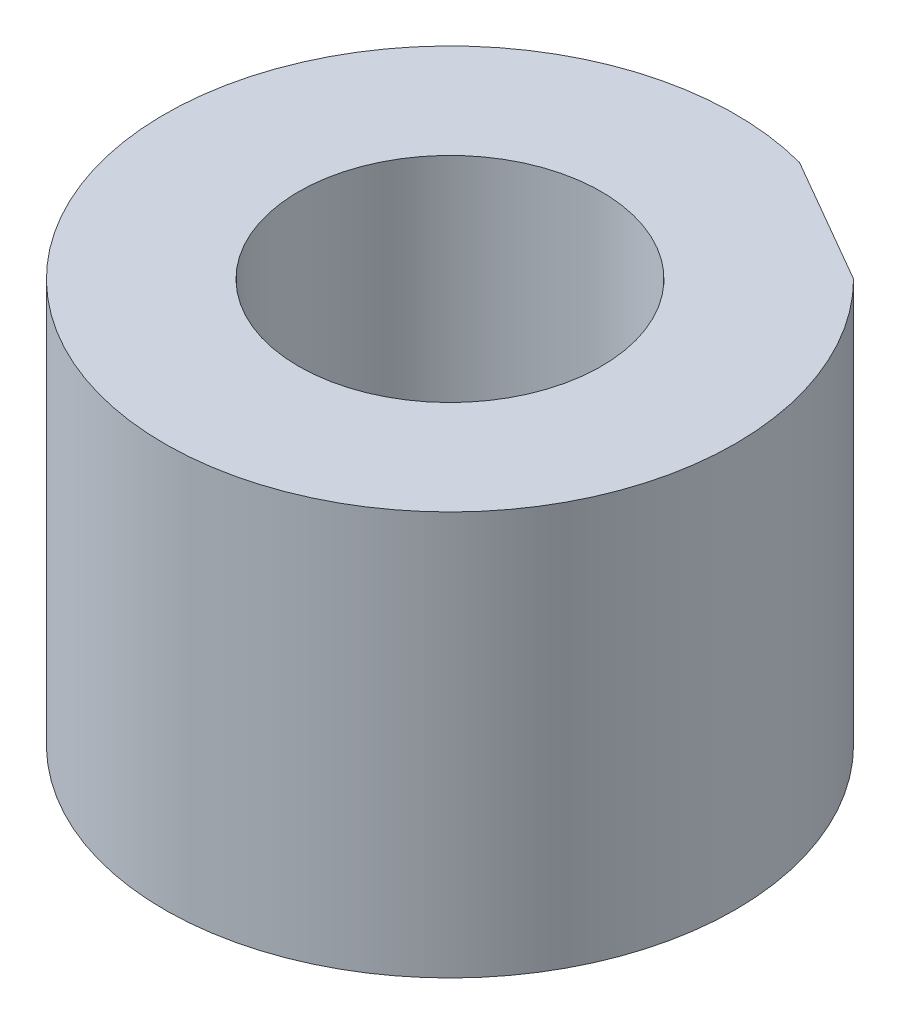
ISO-10303-21;
HEADER;
FILE_DESCRIPTION(('STEP AP214'),'2;1');
FILE_NAME('part.step','',(''),(''),'','','');
FILE_SCHEMA(('AUTOMOTIVE_DESIGN { 1 0 10303 214 1 1 1 1 }'));
ENDSEC;
DATA;
#1=APPLICATION_CONTEXT('core data for automotive mechanical design processes');
#2=APPLICATION_PROTOCOL_DEFINITION('international standard','automotive_design',2000,#1);
#3=PRODUCT_CONTEXT('',#1,'mechanical');
#4=PRODUCT('Part','Part','',(#3));
#5=PRODUCT_RELATED_PRODUCT_CATEGORY('part','',(#4));
#6=PRODUCT_DEFINITION_FORMATION('','',#4);
#7=PRODUCT_DEFINITION_CONTEXT('part definition',#1,'design');
#8=PRODUCT_DEFINITION('design','',#6,#7);
#9=PRODUCT_DEFINITION_SHAPE('','',#8);
#10=(LENGTH_UNIT() NAMED_UNIT(*) SI_UNIT(.MILLI.,.METRE.));
#11=(NAMED_UNIT(*) PLANE_ANGLE_UNIT() SI_UNIT($,.RADIAN.));
#12=(NAMED_UNIT(*) SI_UNIT($,.STERADIAN.) SOLID_ANGLE_UNIT());
#13=UNCERTAINTY_MEASURE_WITH_UNIT(LENGTH_MEASURE(1.E-05),#10,'distance_accuracy_value','');
#14=(GEOMETRIC_REPRESENTATION_CONTEXT(3) GLOBAL_UNCERTAINTY_ASSIGNED_CONTEXT((#13)) GLOBAL_UNIT_ASSIGNED_CONTEXT((#10,
#11,#12)) REPRESENTATION_CONTEXT('',''));
#15=CARTESIAN_POINT('',(0.,0.,0.));
#16=DIRECTION('',(0.,0.,1.));
#17=DIRECTION('',(1.,0.,0.));
#18=AXIS2_PLACEMENT_3D('',#15,#16,#17);
#19=CARTESIAN_POINT('',(12.7,25.4,12.7));
#20=DIRECTION('',(0.,-1.,0.));
#21=DIRECTION('',(0.,0.,-1.));
#22=AXIS2_PLACEMENT_3D('',#19,#20,#21);
#23=CYLINDRICAL_SURFACE('',#22,17.9605122421383);
#24=CARTESIAN_POINT('',(12.7,0.,12.7));
#25=DIRECTION('',(0.,1.,0.));
#26=DIRECTION('',(0.,0.,1.));
#27=AXIS2_PLACEMENT_3D('',#24,#25,#26);
#28=CIRCLE('',#27,17.9605122421383);
#29=CARTESIAN_POINT('',(17.3485226280628,0.,-4.64852262806226));
#30=VERTEX_POINT('',#29);
#31=CARTESIAN_POINT('',(25.4000000000002,0.,0.));
#32=VERTEX_POINT('',#31);
#33=EDGE_CURVE('E67',#30,#32,#28,.T.);
#34=ORIENTED_EDGE('',*,*,#33,.T.);
#35=DIRECTION('',(0.,-1.,0.));
#36=VECTOR('',#35,1.);
#37=CARTESIAN_POINT('',(25.4000000000002,25.4,0.));
#38=LINE('',#37,#36);
#39=CARTESIAN_POINT('',(25.4000000000002,25.4,0.));
#40=VERTEX_POINT('',#39);
#41=EDGE_CURVE('E11',#40,#32,#38,.T.);
#42=ORIENTED_EDGE('',*,*,#41,.F.);
#43=CARTESIAN_POINT('',(12.7,25.4,12.7));
#44=DIRECTION('',(0.,1.,0.));
#45=DIRECTION('',(0.,0.,1.));
#46=AXIS2_PLACEMENT_3D('',#43,#44,#45);
#47=CIRCLE('',#46,17.9605122421383);
#48=CARTESIAN_POINT('',(17.3485226280628,25.4,-4.64852262806226));
#49=VERTEX_POINT('',#48);
#50=EDGE_CURVE('E69',#49,#40,#47,.T.);
#51=ORIENTED_EDGE('',*,*,#50,.F.);
#52=DIRECTION('',(0.,-1.,0.));
#53=VECTOR('',#52,1.);
#54=CARTESIAN_POINT('',(17.3485226280628,25.4,-4.64852262806226));
#55=LINE('',#54,#53);
#56=EDGE_CURVE('E51',#49,#30,#55,.T.);
#57=ORIENTED_EDGE('',*,*,#56,.T.);
#58=EDGE_LOOP('',(#34,#42,#51,#57));
#59=FACE_BOUND('',#58,.T.);
#60=ADVANCED_FACE('F43',(#59),#23,.T.);
#61=CARTESIAN_POINT('',(6.34999999999999,25.4,-10.9985226280625));
#62=DIRECTION('',(0.499999999999997,0.,-0.866025403784441));
#63=DIRECTION('',(-0.866025403784441,0.,-0.499999999999997));
#64=AXIS2_PLACEMENT_3D('',#61,#62,#63);
#65=PLANE('',#64);
#66=DIRECTION('',(0.866025403784441,0.,0.499999999999997));
#67=VECTOR('',#66,1.);
#68=CARTESIAN_POINT('',(6.34999999999999,0.,-10.9985226280625));
#69=LINE('',#68,#67);
#70=EDGE_CURVE('E75',#30,#32,#69,.T.);
#71=ORIENTED_EDGE('',*,*,#70,.F.);
#72=ORIENTED_EDGE('',*,*,#56,.F.);
#73=DIRECTION('',(0.866025403784441,0.,0.499999999999997));
#74=VECTOR('',#73,1.);
#75=CARTESIAN_POINT('',(6.34999999999999,25.4,-10.9985226280625));
#76=LINE('',#75,#74);
#77=EDGE_CURVE('E85',#49,#40,#76,.T.);
#78=ORIENTED_EDGE('',*,*,#77,.T.);
#79=ORIENTED_EDGE('',*,*,#41,.T.);
#80=EDGE_LOOP('',(#71,#72,#78,#79));
#81=FACE_BOUND('',#80,.T.);
#82=ADVANCED_FACE('F77',(#81),#65,.T.);
#83=CARTESIAN_POINT('',(12.7,25.4,12.7));
#84=DIRECTION('',(0.,-1.,0.));
#85=DIRECTION('',(0.,0.,-1.));
#86=AXIS2_PLACEMENT_3D('',#83,#84,#85);
#87=CYLINDRICAL_SURFACE('',#86,9.525);
#88=CARTESIAN_POINT('',(12.7,25.4,12.7));
#89=DIRECTION('',(0.,1.,0.));
#90=DIRECTION('',(0.,0.,1.));
#91=AXIS2_PLACEMENT_3D('',#88,#89,#90);
#92=CIRCLE('',#91,9.525);
#93=CARTESIAN_POINT('',(12.7,25.4,22.225));
#94=VERTEX_POINT('',#93);
#95=EDGE_CURVE('E71',#94,#94,#92,.T.);
#96=ORIENTED_EDGE('',*,*,#95,.T.);
#97=EDGE_LOOP('',(#96));
#98=FACE_BOUND('',#97,.T.);
#99=CARTESIAN_POINT('',(12.7,0.,12.7));
#100=DIRECTION('',(0.,1.,0.));
#101=DIRECTION('',(0.,0.,1.));
#102=AXIS2_PLACEMENT_3D('',#99,#100,#101);
#103=CIRCLE('',#102,9.525);
#104=CARTESIAN_POINT('',(12.7,0.,22.225));
#105=VERTEX_POINT('',#104);
#106=EDGE_CURVE('E78',#105,#105,#103,.T.);
#107=ORIENTED_EDGE('',*,*,#106,.F.);
#108=EDGE_LOOP('',(#107));
#109=FACE_BOUND('',#108,.T.);
#110=ADVANCED_FACE('F91',(#98,#109),#87,.F.);
#111=CARTESIAN_POINT('',(0.,25.4,0.));
#112=DIRECTION('',(0.,1.,0.));
#113=DIRECTION('',(0.,0.,1.));
#114=AXIS2_PLACEMENT_3D('',#111,#112,#113);
#115=PLANE('',#114);
#116=ORIENTED_EDGE('',*,*,#50,.T.);
#117=ORIENTED_EDGE('',*,*,#77,.F.);
#118=EDGE_LOOP('',(#116,#117));
#119=FACE_BOUND('',#118,.T.);
#120=ORIENTED_EDGE('',*,*,#95,.F.);
#121=EDGE_LOOP('',(#120));
#122=FACE_BOUND('',#121,.T.);
#123=ADVANCED_FACE('F88',(#119,#122),#115,.T.);
#124=CARTESIAN_POINT('',(0.,0.,0.));
#125=DIRECTION('',(0.,1.,0.));
#126=DIRECTION('',(0.,0.,1.));
#127=AXIS2_PLACEMENT_3D('',#124,#125,#126);
#128=PLANE('',#127);
#129=ORIENTED_EDGE('',*,*,#33,.F.);
#130=ORIENTED_EDGE('',*,*,#70,.T.);
#131=EDGE_LOOP('',(#129,#130));
#132=FACE_BOUND('',#131,.T.);
#133=ORIENTED_EDGE('',*,*,#106,.T.);
#134=EDGE_LOOP('',(#133));
#135=FACE_BOUND('',#134,.T.);
#136=ADVANCED_FACE('F73',(#132,#135),#128,.F.);
#137=CLOSED_SHELL('',(#60,#82,#110,#123,#136));
#138=MANIFOLD_SOLID_BREP('B2',#137);
#139=ADVANCED_BREP_SHAPE_REPRESENTATION('',(#18,#138),#14);
#140=SHAPE_DEFINITION_REPRESENTATION(#9,#139);
ENDSEC;
END-ISO-10303-21;
